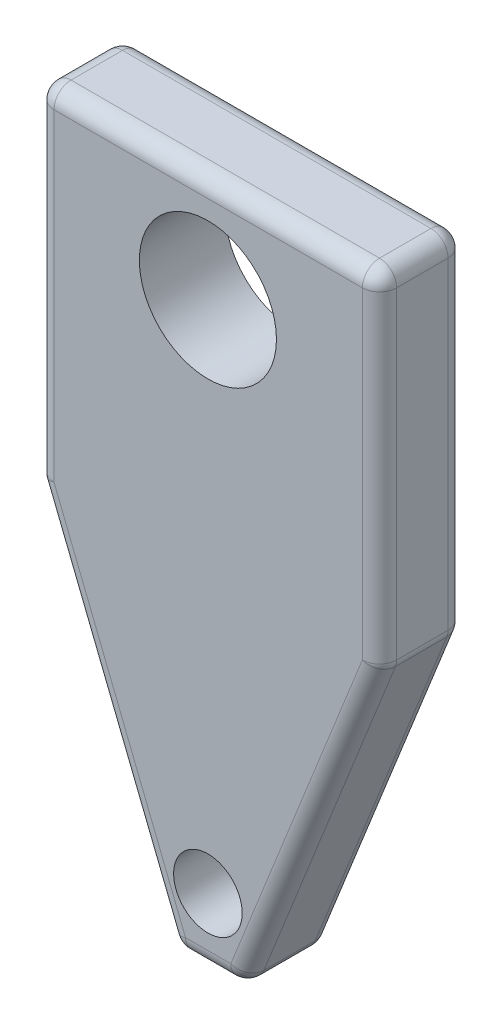
ISO-10303-21;
HEADER;
FILE_DESCRIPTION(('STEP AP214'),'2;1');
FILE_NAME('part.step','',(''),(''),'','','');
FILE_SCHEMA(('AUTOMOTIVE_DESIGN { 1 0 10303 214 1 1 1 1 }'));
ENDSEC;
DATA;
#1=APPLICATION_CONTEXT('core data for automotive mechanical design processes');
#2=APPLICATION_PROTOCOL_DEFINITION('international standard','automotive_design',2000,#1);
#3=PRODUCT_CONTEXT('',#1,'mechanical');
#4=PRODUCT('Part','Part','',(#3));
#5=PRODUCT_RELATED_PRODUCT_CATEGORY('part','',(#4));
#6=PRODUCT_DEFINITION_FORMATION('','',#4);
#7=PRODUCT_DEFINITION_CONTEXT('part definition',#1,'design');
#8=PRODUCT_DEFINITION('design','',#6,#7);
#9=PRODUCT_DEFINITION_SHAPE('','',#8);
#10=(LENGTH_UNIT() NAMED_UNIT(*) SI_UNIT(.MILLI.,.METRE.));
#11=(NAMED_UNIT(*) PLANE_ANGLE_UNIT() SI_UNIT($,.RADIAN.));
#12=(NAMED_UNIT(*) SI_UNIT($,.STERADIAN.) SOLID_ANGLE_UNIT());
#13=UNCERTAINTY_MEASURE_WITH_UNIT(LENGTH_MEASURE(1.E-05),#10,'distance_accuracy_value','');
#14=(GEOMETRIC_REPRESENTATION_CONTEXT(3) GLOBAL_UNCERTAINTY_ASSIGNED_CONTEXT((#13)) GLOBAL_UNIT_ASSIGNED_CONTEXT((#10,
#11,#12)) REPRESENTATION_CONTEXT('',''));
#15=CARTESIAN_POINT('',(0.,0.,0.));
#16=DIRECTION('',(0.,0.,1.));
#17=DIRECTION('',(1.,0.,0.));
#18=AXIS2_PLACEMENT_3D('',#15,#16,#17);
#19=CARTESIAN_POINT('',(0.,0.,5.));
#20=DIRECTION('',(0.,0.,1.));
#21=DIRECTION('',(1.,0.,0.));
#22=AXIS2_PLACEMENT_3D('',#19,#20,#21);
#23=PLANE('',#22);
#24=DIRECTION('',(0.,1.,0.));
#25=VECTOR('',#24,1.);
#26=CARTESIAN_POINT('',(19.,0.,5.));
#27=LINE('',#26,#25);
#28=CARTESIAN_POINT('',(19.,-19.8074175964328,5.));
#29=VERTEX_POINT('',#28);
#30=CARTESIAN_POINT('',(19.,-1.,5.));
#31=VERTEX_POINT('',#30);
#32=EDGE_CURVE('E193',#29,#31,#27,.T.);
#33=ORIENTED_EDGE('',*,*,#32,.T.);
#34=DIRECTION('',(-1.,0.,0.));
#35=VECTOR('',#34,1.);
#36=CARTESIAN_POINT('',(0.,-1.,5.));
#37=LINE('',#36,#35);
#38=CARTESIAN_POINT('',(1.,-1.,5.));
#39=VERTEX_POINT('',#38);
#40=EDGE_CURVE('E199',#31,#39,#37,.T.);
#41=ORIENTED_EDGE('',*,*,#40,.T.);
#42=DIRECTION('',(0.,-1.,0.));
#43=VECTOR('',#42,1.);
#44=CARTESIAN_POINT('',(1.,-20.,5.));
#45=LINE('',#44,#43);
#46=CARTESIAN_POINT('',(1.,-19.8074175964327,5.));
#47=VERTEX_POINT('',#46);
#48=EDGE_CURVE('E191',#39,#47,#45,.T.);
#49=ORIENTED_EDGE('',*,*,#48,.T.);
#50=DIRECTION('',(0.371390676354104,-0.928476690885259,0.));
#51=VECTOR('',#50,1.);
#52=CARTESIAN_POINT('',(8.92847669088527,-39.6286093236459,5.));
#53=LINE('',#52,#51);
#54=CARTESIAN_POINT('',(8.6770329614269,-39.,5.));
#55=VERTEX_POINT('',#54);
#56=EDGE_CURVE('E162',#47,#55,#53,.T.);
#57=ORIENTED_EDGE('',*,*,#56,.T.);
#58=DIRECTION('',(1.,0.,0.));
#59=VECTOR('',#58,1.);
#60=CARTESIAN_POINT('',(12.,-39.,5.));
#61=LINE('',#60,#59);
#62=CARTESIAN_POINT('',(11.3229670385731,-39.,5.));
#63=VERTEX_POINT('',#62);
#64=EDGE_CURVE('E180',#55,#63,#61,.T.);
#65=ORIENTED_EDGE('',*,*,#64,.T.);
#66=DIRECTION('',(0.371390676354104,0.928476690885259,0.));
#67=VECTOR('',#66,1.);
#68=CARTESIAN_POINT('',(19.0715233091147,-19.6286093236459,5.));
#69=LINE('',#68,#67);
#70=EDGE_CURVE('E186',#63,#29,#69,.T.);
#71=ORIENTED_EDGE('',*,*,#70,.T.);
#72=EDGE_LOOP('',(#33,#41,#49,#57,#65,#71));
#73=FACE_BOUND('',#72,.T.);
#74=CARTESIAN_POINT('',(9.98459852662277,-6.11486343196653,5.));
#75=DIRECTION('',(0.,0.,1.));
#76=DIRECTION('',(1.,0.,0.));
#77=AXIS2_PLACEMENT_3D('',#74,#75,#76);
#78=CIRCLE('',#77,4.);
#79=CARTESIAN_POINT('',(13.9845985266228,-6.11486343196653,5.));
#80=VERTEX_POINT('',#79);
#81=EDGE_CURVE('E187',#80,#80,#78,.T.);
#82=ORIENTED_EDGE('',*,*,#81,.F.);
#83=EDGE_LOOP('',(#82));
#84=FACE_BOUND('',#83,.T.);
#85=CARTESIAN_POINT('',(9.98459852662277,-36.1148634319665,5.));
#86=DIRECTION('',(0.,0.,1.));
#87=DIRECTION('',(1.,0.,0.));
#88=AXIS2_PLACEMENT_3D('',#85,#86,#87);
#89=CIRCLE('',#88,2.);
#90=CARTESIAN_POINT('',(11.9845985266228,-36.1148634319665,5.));
#91=VERTEX_POINT('',#90);
#92=EDGE_CURVE('E358',#91,#91,#89,.T.);
#93=ORIENTED_EDGE('',*,*,#92,.F.);
#94=EDGE_LOOP('',(#93));
#95=FACE_BOUND('',#94,.T.);
#96=ADVANCED_FACE('F33',(#73,#84,#95),#23,.T.);
#97=CARTESIAN_POINT('',(0.,0.,0.));
#98=DIRECTION('',(0.,0.,1.));
#99=DIRECTION('',(1.,0.,0.));
#100=AXIS2_PLACEMENT_3D('',#97,#98,#99);
#101=PLANE('',#100);
#102=DIRECTION('',(0.,-1.,0.));
#103=VECTOR('',#102,1.);
#104=CARTESIAN_POINT('',(1.,0.,0.));
#105=LINE('',#104,#103);
#106=CARTESIAN_POINT('',(1.,-19.8074175964327,0.));
#107=VERTEX_POINT('',#106);
#108=CARTESIAN_POINT('',(1.,-1.,0.));
#109=VERTEX_POINT('',#108);
#110=EDGE_CURVE('E226',#107,#109,#105,.F.);
#111=ORIENTED_EDGE('',*,*,#110,.T.);
#112=DIRECTION('',(-1.,0.,0.));
#113=VECTOR('',#112,1.);
#114=CARTESIAN_POINT('',(0.,-1.,0.));
#115=LINE('',#114,#113);
#116=CARTESIAN_POINT('',(19.,-1.,0.));
#117=VERTEX_POINT('',#116);
#118=EDGE_CURVE('E228',#109,#117,#115,.F.);
#119=ORIENTED_EDGE('',*,*,#118,.T.);
#120=DIRECTION('',(0.,1.,0.));
#121=VECTOR('',#120,1.);
#122=CARTESIAN_POINT('',(19.,0.,0.));
#123=LINE('',#122,#121);
#124=CARTESIAN_POINT('',(19.,-19.8074175964327,0.));
#125=VERTEX_POINT('',#124);
#126=EDGE_CURVE('E224',#117,#125,#123,.F.);
#127=ORIENTED_EDGE('',*,*,#126,.T.);
#128=DIRECTION('',(0.371390676354104,0.928476690885259,0.));
#129=VECTOR('',#128,1.);
#130=CARTESIAN_POINT('',(23.2094543435975,-9.283781737439,0.));
#131=LINE('',#130,#129);
#132=CARTESIAN_POINT('',(11.3229670385731,-39.,0.));
#133=VERTEX_POINT('',#132);
#134=EDGE_CURVE('E219',#125,#133,#131,.F.);
#135=ORIENTED_EDGE('',*,*,#134,.T.);
#136=DIRECTION('',(1.,0.,0.));
#137=VECTOR('',#136,1.);
#138=CARTESIAN_POINT('',(0.,-39.,0.));
#139=LINE('',#138,#137);
#140=CARTESIAN_POINT('',(8.67703296142691,-39.,0.));
#141=VERTEX_POINT('',#140);
#142=EDGE_CURVE('E217',#133,#141,#139,.F.);
#143=ORIENTED_EDGE('',*,*,#142,.T.);
#144=DIRECTION('',(0.371390676354104,-0.928476690885259,0.));
#145=VECTOR('',#144,1.);
#146=CARTESIAN_POINT('',(-5.96807503325267,-2.38723001330107,0.));
#147=LINE('',#146,#145);
#148=EDGE_CURVE('E221',#141,#107,#147,.F.);
#149=ORIENTED_EDGE('',*,*,#148,.T.);
#150=EDGE_LOOP('',(#111,#119,#127,#135,#143,#149));
#151=FACE_BOUND('',#150,.T.);
#152=CARTESIAN_POINT('',(9.98459852662277,-6.11486343196653,0.));
#153=DIRECTION('',(0.,0.,1.));
#154=DIRECTION('',(1.,0.,0.));
#155=AXIS2_PLACEMENT_3D('',#152,#153,#154);
#156=CIRCLE('',#155,4.);
#157=CARTESIAN_POINT('',(13.9845985266228,-6.11486343196653,0.));
#158=VERTEX_POINT('',#157);
#159=EDGE_CURVE('E363',#158,#158,#156,.T.);
#160=ORIENTED_EDGE('',*,*,#159,.T.);
#161=EDGE_LOOP('',(#160));
#162=FACE_BOUND('',#161,.T.);
#163=CARTESIAN_POINT('',(9.98459852662277,-36.1148634319665,0.));
#164=DIRECTION('',(0.,0.,1.));
#165=DIRECTION('',(1.,0.,0.));
#166=AXIS2_PLACEMENT_3D('',#163,#164,#165);
#167=CIRCLE('',#166,2.);
#168=CARTESIAN_POINT('',(11.9845985266228,-36.1148634319665,0.));
#169=VERTEX_POINT('',#168);
#170=EDGE_CURVE('E352',#169,#169,#167,.T.);
#171=ORIENTED_EDGE('',*,*,#170,.T.);
#172=EDGE_LOOP('',(#171));
#173=FACE_BOUND('',#172,.T.);
#174=ADVANCED_FACE('F371',(#151,#162,#173),#101,.F.);
#175=CARTESIAN_POINT('',(0.,0.,5.));
#176=DIRECTION('',(1.,0.,0.));
#177=DIRECTION('',(0.,1.,0.));
#178=AXIS2_PLACEMENT_3D('',#175,#176,#177);
#179=PLANE('',#178);
#180=DIRECTION('',(0.,0.,-1.));
#181=VECTOR('',#180,1.);
#182=CARTESIAN_POINT('',(0.,-19.8074175964327,5.));
#183=LINE('',#182,#181);
#184=CARTESIAN_POINT('',(0.,-19.8074175964327,1.));
#185=VERTEX_POINT('',#184);
#186=CARTESIAN_POINT('',(0.,-19.8074175964327,4.));
#187=VERTEX_POINT('',#186);
#188=EDGE_CURVE('E234',#185,#187,#183,.F.);
#189=ORIENTED_EDGE('',*,*,#188,.T.);
#190=DIRECTION('',(0.,-1.,0.));
#191=VECTOR('',#190,1.);
#192=CARTESIAN_POINT('',(0.,0.,4.));
#193=LINE('',#192,#191);
#194=CARTESIAN_POINT('',(0.,-1.,4.));
#195=VERTEX_POINT('',#194);
#196=EDGE_CURVE('E236',#187,#195,#193,.F.);
#197=ORIENTED_EDGE('',*,*,#196,.T.);
#198=DIRECTION('',(0.,0.,-1.));
#199=VECTOR('',#198,1.);
#200=CARTESIAN_POINT('',(0.,-1.,5.));
#201=LINE('',#200,#199);
#202=CARTESIAN_POINT('',(0.,-1.,1.));
#203=VERTEX_POINT('',#202);
#204=EDGE_CURVE('E230',#195,#203,#201,.T.);
#205=ORIENTED_EDGE('',*,*,#204,.T.);
#206=DIRECTION('',(0.,-1.,0.));
#207=VECTOR('',#206,1.);
#208=CARTESIAN_POINT('',(0.,0.,1.));
#209=LINE('',#208,#207);
#210=EDGE_CURVE('E232',#203,#185,#209,.T.);
#211=ORIENTED_EDGE('',*,*,#210,.T.);
#212=EDGE_LOOP('',(#189,#197,#205,#211));
#213=FACE_BOUND('',#212,.T.);
#214=ADVANCED_FACE('F392',(#213),#179,.F.);
#215=CARTESIAN_POINT('',(0.,-20.,5.));
#216=DIRECTION('',(0.928476690885259,0.371390676354104,0.));
#217=DIRECTION('',(-0.371390676354104,0.928476690885259,0.));
#218=AXIS2_PLACEMENT_3D('',#215,#216,#217);
#219=PLANE('',#218);
#220=DIRECTION('',(0.,0.,-1.));
#221=VECTOR('',#220,1.);
#222=CARTESIAN_POINT('',(7.74855627054165,-39.3713906763541,5.));
#223=LINE('',#222,#221);
#224=CARTESIAN_POINT('',(7.74855627054165,-39.3713906763541,1.));
#225=VERTEX_POINT('',#224);
#226=CARTESIAN_POINT('',(7.74855627054165,-39.3713906763541,4.));
#227=VERTEX_POINT('',#226);
#228=EDGE_CURVE('E205',#225,#227,#223,.F.);
#229=ORIENTED_EDGE('',*,*,#228,.T.);
#230=DIRECTION('',(0.371390676354104,-0.928476690885259,0.));
#231=VECTOR('',#230,1.);
#232=CARTESIAN_POINT('',(0.,-20.,4.));
#233=LINE('',#232,#231);
#234=CARTESIAN_POINT('',(0.071523309114743,-20.1788082727869,4.));
#235=VERTEX_POINT('',#234);
#236=EDGE_CURVE('E164',#227,#235,#233,.F.);
#237=ORIENTED_EDGE('',*,*,#236,.T.);
#238=DIRECTION('',(0.,0.,-1.));
#239=VECTOR('',#238,1.);
#240=CARTESIAN_POINT('',(0.071523309114743,-20.1788082727869,5.));
#241=LINE('',#240,#239);
#242=CARTESIAN_POINT('',(0.071523309114743,-20.1788082727869,1.));
#243=VERTEX_POINT('',#242);
#244=EDGE_CURVE('E201',#235,#243,#241,.T.);
#245=ORIENTED_EDGE('',*,*,#244,.T.);
#246=DIRECTION('',(0.371390676354104,-0.928476690885259,0.));
#247=VECTOR('',#246,1.);
#248=CARTESIAN_POINT('',(0.,-20.,1.));
#249=LINE('',#248,#247);
#250=EDGE_CURVE('E203',#243,#225,#249,.T.);
#251=ORIENTED_EDGE('',*,*,#250,.T.);
#252=EDGE_LOOP('',(#229,#237,#245,#251));
#253=FACE_BOUND('',#252,.T.);
#254=ADVANCED_FACE('F406',(#253),#219,.F.);
#255=CARTESIAN_POINT('',(8.00000000000001,-40.,5.));
#256=DIRECTION('',(0.,1.,0.));
#257=DIRECTION('',(0.,0.,1.));
#258=AXIS2_PLACEMENT_3D('',#255,#256,#257);
#259=PLANE('',#258);
#260=DIRECTION('',(0.,0.,-1.));
#261=VECTOR('',#260,1.);
#262=CARTESIAN_POINT('',(8.67703296142691,-40.,5.));
#263=LINE('',#262,#261);
#264=CARTESIAN_POINT('',(8.67703296142691,-40.,4.));
#265=VERTEX_POINT('',#264);
#266=CARTESIAN_POINT('',(8.67703296142691,-40.,1.));
#267=VERTEX_POINT('',#266);
#268=EDGE_CURVE('E212',#265,#267,#263,.T.);
#269=ORIENTED_EDGE('',*,*,#268,.T.);
#270=DIRECTION('',(1.,0.,0.));
#271=VECTOR('',#270,1.);
#272=CARTESIAN_POINT('',(8.00000000000001,-40.,1.));
#273=LINE('',#272,#271);
#274=CARTESIAN_POINT('',(11.3229670385731,-40.,1.));
#275=VERTEX_POINT('',#274);
#276=EDGE_CURVE('E215',#267,#275,#273,.T.);
#277=ORIENTED_EDGE('',*,*,#276,.T.);
#278=DIRECTION('',(0.,0.,-1.));
#279=VECTOR('',#278,1.);
#280=CARTESIAN_POINT('',(11.3229670385731,-40.,5.));
#281=LINE('',#280,#279);
#282=CARTESIAN_POINT('',(11.3229670385731,-40.,4.));
#283=VERTEX_POINT('',#282);
#284=EDGE_CURVE('E210',#275,#283,#281,.F.);
#285=ORIENTED_EDGE('',*,*,#284,.T.);
#286=DIRECTION('',(1.,0.,0.));
#287=VECTOR('',#286,1.);
#288=CARTESIAN_POINT('',(8.00000000000001,-40.,4.));
#289=LINE('',#288,#287);
#290=EDGE_CURVE('E208',#283,#265,#289,.F.);
#291=ORIENTED_EDGE('',*,*,#290,.T.);
#292=EDGE_LOOP('',(#269,#277,#285,#291));
#293=FACE_BOUND('',#292,.T.);
#294=ADVANCED_FACE('F402',(#293),#259,.F.);
#295=CARTESIAN_POINT('',(20.,-20.,5.));
#296=DIRECTION('',(-0.928476690885259,0.371390676354104,0.));
#297=DIRECTION('',(-0.371390676354104,-0.928476690885259,0.));
#298=AXIS2_PLACEMENT_3D('',#295,#296,#297);
#299=PLANE('',#298);
#300=DIRECTION('',(0.371390676354104,0.928476690885259,0.));
#301=VECTOR('',#300,1.);
#302=CARTESIAN_POINT('',(12.,-40.,4.));
#303=LINE('',#302,#301);
#304=CARTESIAN_POINT('',(19.9284766908853,-20.1788082727869,4.));
#305=VERTEX_POINT('',#304);
#306=CARTESIAN_POINT('',(12.2514437294584,-39.3713906763541,4.));
#307=VERTEX_POINT('',#306);
#308=EDGE_CURVE('E243',#305,#307,#303,.F.);
#309=ORIENTED_EDGE('',*,*,#308,.T.);
#310=DIRECTION('',(0.,0.,-1.));
#311=VECTOR('',#310,1.);
#312=CARTESIAN_POINT('',(12.2514437294584,-39.3713906763541,5.));
#313=LINE('',#312,#311);
#314=CARTESIAN_POINT('',(12.2514437294584,-39.3713906763541,1.));
#315=VERTEX_POINT('',#314);
#316=EDGE_CURVE('E245',#307,#315,#313,.T.);
#317=ORIENTED_EDGE('',*,*,#316,.T.);
#318=DIRECTION('',(0.371390676354104,0.928476690885259,0.));
#319=VECTOR('',#318,1.);
#320=CARTESIAN_POINT('',(20.,-20.,1.));
#321=LINE('',#320,#319);
#322=CARTESIAN_POINT('',(19.9284766908853,-20.1788082727869,1.));
#323=VERTEX_POINT('',#322);
#324=EDGE_CURVE('E241',#315,#323,#321,.T.);
#325=ORIENTED_EDGE('',*,*,#324,.T.);
#326=DIRECTION('',(0.,0.,-1.));
#327=VECTOR('',#326,1.);
#328=CARTESIAN_POINT('',(19.9284766908853,-20.1788082727869,5.));
#329=LINE('',#328,#327);
#330=EDGE_CURVE('E239',#323,#305,#329,.F.);
#331=ORIENTED_EDGE('',*,*,#330,.T.);
#332=EDGE_LOOP('',(#309,#317,#325,#331));
#333=FACE_BOUND('',#332,.T.);
#334=ADVANCED_FACE('F398',(#333),#299,.F.);
#335=CARTESIAN_POINT('',(20.,0.,5.));
#336=DIRECTION('',(-1.,0.,0.));
#337=DIRECTION('',(0.,-1.,0.));
#338=AXIS2_PLACEMENT_3D('',#335,#336,#337);
#339=PLANE('',#338);
#340=DIRECTION('',(0.,1.,0.));
#341=VECTOR('',#340,1.);
#342=CARTESIAN_POINT('',(20.,-20.,4.));
#343=LINE('',#342,#341);
#344=CARTESIAN_POINT('',(20.,-1.,4.));
#345=VERTEX_POINT('',#344);
#346=CARTESIAN_POINT('',(20.,-19.8074175964327,4.));
#347=VERTEX_POINT('',#346);
#348=EDGE_CURVE('E252',#345,#347,#343,.F.);
#349=ORIENTED_EDGE('',*,*,#348,.T.);
#350=DIRECTION('',(0.,0.,-1.));
#351=VECTOR('',#350,1.);
#352=CARTESIAN_POINT('',(20.,-19.8074175964327,5.));
#353=LINE('',#352,#351);
#354=CARTESIAN_POINT('',(20.,-19.8074175964327,1.));
#355=VERTEX_POINT('',#354);
#356=EDGE_CURVE('E254',#347,#355,#353,.T.);
#357=ORIENTED_EDGE('',*,*,#356,.T.);
#358=DIRECTION('',(0.,1.,0.));
#359=VECTOR('',#358,1.);
#360=CARTESIAN_POINT('',(20.,0.,1.));
#361=LINE('',#360,#359);
#362=CARTESIAN_POINT('',(20.,-1.,1.));
#363=VERTEX_POINT('',#362);
#364=EDGE_CURVE('E250',#355,#363,#361,.T.);
#365=ORIENTED_EDGE('',*,*,#364,.T.);
#366=DIRECTION('',(0.,0.,-1.));
#367=VECTOR('',#366,1.);
#368=CARTESIAN_POINT('',(20.,-1.,5.));
#369=LINE('',#368,#367);
#370=EDGE_CURVE('E248',#363,#345,#369,.F.);
#371=ORIENTED_EDGE('',*,*,#370,.T.);
#372=EDGE_LOOP('',(#349,#357,#365,#371));
#373=FACE_BOUND('',#372,.T.);
#374=ADVANCED_FACE('F385',(#373),#339,.F.);
#375=CARTESIAN_POINT('',(0.,0.,5.));
#376=DIRECTION('',(0.,-1.,0.));
#377=DIRECTION('',(0.,0.,-1.));
#378=AXIS2_PLACEMENT_3D('',#375,#376,#377);
#379=PLANE('',#378);
#380=DIRECTION('',(-1.,0.,0.));
#381=VECTOR('',#380,1.);
#382=CARTESIAN_POINT('',(20.,0.,4.));
#383=LINE('',#382,#381);
#384=CARTESIAN_POINT('',(1.,0.,4.));
#385=VERTEX_POINT('',#384);
#386=CARTESIAN_POINT('',(19.,0.,4.));
#387=VERTEX_POINT('',#386);
#388=EDGE_CURVE('E42',#385,#387,#383,.F.);
#389=ORIENTED_EDGE('',*,*,#388,.T.);
#390=DIRECTION('',(0.,0.,-1.));
#391=VECTOR('',#390,1.);
#392=CARTESIAN_POINT('',(19.,0.,5.));
#393=LINE('',#392,#391);
#394=CARTESIAN_POINT('',(19.,0.,1.));
#395=VERTEX_POINT('',#394);
#396=EDGE_CURVE('E11',#387,#395,#393,.T.);
#397=ORIENTED_EDGE('',*,*,#396,.T.);
#398=DIRECTION('',(-1.,0.,0.));
#399=VECTOR('',#398,1.);
#400=CARTESIAN_POINT('',(0.,0.,1.));
#401=LINE('',#400,#399);
#402=CARTESIAN_POINT('',(1.,0.,1.));
#403=VERTEX_POINT('',#402);
#404=EDGE_CURVE('E257',#395,#403,#401,.T.);
#405=ORIENTED_EDGE('',*,*,#404,.T.);
#406=DIRECTION('',(0.,0.,-1.));
#407=VECTOR('',#406,1.);
#408=CARTESIAN_POINT('',(1.,0.,5.));
#409=LINE('',#408,#407);
#410=EDGE_CURVE('E53',#403,#385,#409,.F.);
#411=ORIENTED_EDGE('',*,*,#410,.T.);
#412=EDGE_LOOP('',(#389,#397,#405,#411));
#413=FACE_BOUND('',#412,.T.);
#414=ADVANCED_FACE('F376',(#413),#379,.F.);
#415=CARTESIAN_POINT('',(9.98459852662277,-6.11486343196653,5.));
#416=DIRECTION('',(0.,0.,-1.));
#417=DIRECTION('',(-1.,0.,0.));
#418=AXIS2_PLACEMENT_3D('',#415,#416,#417);
#419=CYLINDRICAL_SURFACE('',#418,4.);
#420=ORIENTED_EDGE('',*,*,#81,.T.);
#421=EDGE_LOOP('',(#420));
#422=FACE_BOUND('',#421,.T.);
#423=ORIENTED_EDGE('',*,*,#159,.F.);
#424=EDGE_LOOP('',(#423));
#425=FACE_BOUND('',#424,.T.);
#426=ADVANCED_FACE('F373',(#422,#425),#419,.F.);
#427=CARTESIAN_POINT('',(9.98459852662277,-36.1148634319665,5.));
#428=DIRECTION('',(0.,0.,-1.));
#429=DIRECTION('',(-1.,0.,0.));
#430=AXIS2_PLACEMENT_3D('',#427,#428,#429);
#431=CYLINDRICAL_SURFACE('',#430,2.);
#432=ORIENTED_EDGE('',*,*,#92,.T.);
#433=EDGE_LOOP('',(#432));
#434=FACE_BOUND('',#433,.T.);
#435=ORIENTED_EDGE('',*,*,#170,.F.);
#436=EDGE_LOOP('',(#435));
#437=FACE_BOUND('',#436,.T.);
#438=ADVANCED_FACE('F375',(#434,#437),#431,.F.);
#439=CARTESIAN_POINT('',(19.,0.,1.));
#440=DIRECTION('',(0.,1.,0.));
#441=DIRECTION('',(-1.,0.,0.));
#442=AXIS2_PLACEMENT_3D('',#439,#440,#441);
#443=CYLINDRICAL_SURFACE('',#442,1.);
#444=CARTESIAN_POINT('',(19.,-1.,1.));
#445=DIRECTION('',(0.,1.,0.));
#446=DIRECTION('',(-1.,0.,0.));
#447=AXIS2_PLACEMENT_3D('',#444,#445,#446);
#448=CIRCLE('',#447,1.);
#449=EDGE_CURVE('E37',#363,#117,#448,.T.);
#450=ORIENTED_EDGE('',*,*,#449,.F.);
#451=ORIENTED_EDGE('',*,*,#364,.F.);
#452=CARTESIAN_POINT('',(19.,-19.8074175964327,1.));
#453=DIRECTION('',(0.,-1.,0.));
#454=DIRECTION('',(0.,0.,-1.));
#455=AXIS2_PLACEMENT_3D('',#452,#453,#454);
#456=CIRCLE('',#455,1.);
#457=EDGE_CURVE('E344',#125,#355,#456,.T.);
#458=ORIENTED_EDGE('',*,*,#457,.F.);
#459=ORIENTED_EDGE('',*,*,#126,.F.);
#460=EDGE_LOOP('',(#450,#451,#458,#459));
#461=FACE_BOUND('',#460,.T.);
#462=ADVANCED_FACE('F35',(#461),#443,.T.);
#463=CARTESIAN_POINT('',(19.,-1.,1.));
#464=DIRECTION('',(0.,0.,1.));
#465=DIRECTION('',(1.,0.,0.));
#466=AXIS2_PLACEMENT_3D('',#463,#464,#465);
#467=SPHERICAL_SURFACE('',#466,1.);
#468=CARTESIAN_POINT('',(19.,-1.,1.));
#469=DIRECTION('',(0.,0.,-1.));
#470=DIRECTION('',(-1.,0.,0.));
#471=AXIS2_PLACEMENT_3D('',#468,#469,#470);
#472=CIRCLE('',#471,1.);
#473=EDGE_CURVE('E339',#363,#395,#472,.F.);
#474=ORIENTED_EDGE('',*,*,#473,.F.);
#475=ORIENTED_EDGE('',*,*,#449,.T.);
#476=CARTESIAN_POINT('',(19.,-1.,1.));
#477=DIRECTION('',(1.,0.,0.));
#478=DIRECTION('',(0.,0.,-1.));
#479=AXIS2_PLACEMENT_3D('',#476,#477,#478);
#480=CIRCLE('',#479,1.);
#481=EDGE_CURVE('E342',#395,#117,#480,.F.);
#482=ORIENTED_EDGE('',*,*,#481,.F.);
#483=EDGE_LOOP('',(#474,#475,#482));
#484=FACE_BOUND('',#483,.T.);
#485=ADVANCED_FACE('F518',(#484),#467,.T.);
#486=CARTESIAN_POINT('',(19.,-19.8074175964327,1.));
#487=DIRECTION('',(0.,0.,1.));
#488=DIRECTION('',(1.,0.,0.));
#489=AXIS2_PLACEMENT_3D('',#486,#487,#488);
#490=SPHERICAL_SURFACE('',#489,1.);
#491=CARTESIAN_POINT('',(19.,-19.8074175964327,1.));
#492=DIRECTION('',(0.371390676354104,0.928476690885259,0.));
#493=DIRECTION('',(-0.928476690885259,0.371390676354104,0.));
#494=AXIS2_PLACEMENT_3D('',#491,#492,#493);
#495=CIRCLE('',#494,1.);
#496=EDGE_CURVE('E334',#125,#323,#495,.F.);
#497=ORIENTED_EDGE('',*,*,#496,.F.);
#498=ORIENTED_EDGE('',*,*,#457,.T.);
#499=CARTESIAN_POINT('',(19.,-19.8074175964327,1.));
#500=DIRECTION('',(0.,0.,-1.));
#501=DIRECTION('',(-1.,0.,0.));
#502=AXIS2_PLACEMENT_3D('',#499,#500,#501);
#503=CIRCLE('',#502,1.);
#504=EDGE_CURVE('E337',#323,#355,#503,.F.);
#505=ORIENTED_EDGE('',*,*,#504,.F.);
#506=EDGE_LOOP('',(#497,#498,#505));
#507=FACE_BOUND('',#506,.T.);
#508=ADVANCED_FACE('F515',(#507),#490,.T.);
#509=CARTESIAN_POINT('',(0.,-1.,1.));
#510=DIRECTION('',(-1.,0.,0.));
#511=DIRECTION('',(0.,0.,1.));
#512=AXIS2_PLACEMENT_3D('',#509,#510,#511);
#513=CYLINDRICAL_SURFACE('',#512,1.);
#514=ORIENTED_EDGE('',*,*,#481,.T.);
#515=ORIENTED_EDGE('',*,*,#118,.F.);
#516=CARTESIAN_POINT('',(1.,-1.,1.));
#517=DIRECTION('',(-1.,0.,0.));
#518=DIRECTION('',(0.,0.,1.));
#519=AXIS2_PLACEMENT_3D('',#516,#517,#518);
#520=CIRCLE('',#519,1.);
#521=EDGE_CURVE('E331',#403,#109,#520,.T.);
#522=ORIENTED_EDGE('',*,*,#521,.F.);
#523=ORIENTED_EDGE('',*,*,#404,.F.);
#524=EDGE_LOOP('',(#514,#515,#522,#523));
#525=FACE_BOUND('',#524,.T.);
#526=ADVANCED_FACE('F511',(#525),#513,.T.);
#527=CARTESIAN_POINT('',(19.,-1.,5.));
#528=DIRECTION('',(0.,0.,-1.));
#529=DIRECTION('',(-1.,0.,0.));
#530=AXIS2_PLACEMENT_3D('',#527,#528,#529);
#531=CYLINDRICAL_SURFACE('',#530,1.);
#532=ORIENTED_EDGE('',*,*,#473,.T.);
#533=ORIENTED_EDGE('',*,*,#396,.F.);
#534=CARTESIAN_POINT('',(19.,-1.,4.));
#535=DIRECTION('',(0.,0.,1.));
#536=DIRECTION('',(1.,0.,0.));
#537=AXIS2_PLACEMENT_3D('',#534,#535,#536);
#538=CIRCLE('',#537,1.);
#539=EDGE_CURVE('E328',#345,#387,#538,.T.);
#540=ORIENTED_EDGE('',*,*,#539,.F.);
#541=ORIENTED_EDGE('',*,*,#370,.F.);
#542=EDGE_LOOP('',(#532,#533,#540,#541));
#543=FACE_BOUND('',#542,.T.);
#544=ADVANCED_FACE('F507',(#543),#531,.T.);
#545=CARTESIAN_POINT('',(19.,0.,4.));
#546=DIRECTION('',(0.,-1.,0.));
#547=DIRECTION('',(1.,0.,0.));
#548=AXIS2_PLACEMENT_3D('',#545,#546,#547);
#549=CYLINDRICAL_SURFACE('',#548,1.);
#550=CARTESIAN_POINT('',(19.,-19.8074175964327,4.));
#551=DIRECTION('',(0.,-1.,0.));
#552=DIRECTION('',(0.,0.,-1.));
#553=AXIS2_PLACEMENT_3D('',#550,#551,#552);
#554=CIRCLE('',#553,1.);
#555=EDGE_CURVE('E322',#347,#29,#554,.T.);
#556=ORIENTED_EDGE('',*,*,#555,.F.);
#557=ORIENTED_EDGE('',*,*,#348,.F.);
#558=CARTESIAN_POINT('',(19.,-1.,4.));
#559=DIRECTION('',(0.,1.,0.));
#560=DIRECTION('',(-1.,0.,0.));
#561=AXIS2_PLACEMENT_3D('',#558,#559,#560);
#562=CIRCLE('',#561,1.);
#563=EDGE_CURVE('E325',#31,#345,#562,.T.);
#564=ORIENTED_EDGE('',*,*,#563,.F.);
#565=ORIENTED_EDGE('',*,*,#32,.F.);
#566=EDGE_LOOP('',(#556,#557,#564,#565));
#567=FACE_BOUND('',#566,.T.);
#568=ADVANCED_FACE('F503',(#567),#549,.T.);
#569=CARTESIAN_POINT('',(19.,-19.8074175964327,5.));
#570=DIRECTION('',(0.,0.,-1.));
#571=DIRECTION('',(-1.,0.,0.));
#572=AXIS2_PLACEMENT_3D('',#569,#570,#571);
#573=CYLINDRICAL_SURFACE('',#572,1.);
#574=ORIENTED_EDGE('',*,*,#504,.T.);
#575=ORIENTED_EDGE('',*,*,#356,.F.);
#576=CARTESIAN_POINT('',(19.,-19.8074175964327,4.));
#577=DIRECTION('',(0.,0.,1.));
#578=DIRECTION('',(1.,0.,0.));
#579=AXIS2_PLACEMENT_3D('',#576,#577,#578);
#580=CIRCLE('',#579,1.);
#581=EDGE_CURVE('E319',#305,#347,#580,.T.);
#582=ORIENTED_EDGE('',*,*,#581,.F.);
#583=ORIENTED_EDGE('',*,*,#330,.F.);
#584=EDGE_LOOP('',(#574,#575,#582,#583));
#585=FACE_BOUND('',#584,.T.);
#586=ADVANCED_FACE('F499',(#585),#573,.T.);
#587=CARTESIAN_POINT('',(19.0715233091147,-19.6286093236459,1.));
#588=DIRECTION('',(0.371390676354104,0.928476690885259,0.));
#589=DIRECTION('',(-0.928476690885259,0.371390676354104,0.));
#590=AXIS2_PLACEMENT_3D('',#587,#588,#589);
#591=CYLINDRICAL_SURFACE('',#590,1.);
#592=ORIENTED_EDGE('',*,*,#496,.T.);
#593=ORIENTED_EDGE('',*,*,#324,.F.);
#594=CARTESIAN_POINT('',(11.3229670385731,-39.,1.));
#595=DIRECTION('',(-0.371390676354104,-0.928476690885259,0.));
#596=DIRECTION('',(0.928476690885259,-0.371390676354104,0.));
#597=AXIS2_PLACEMENT_3D('',#594,#595,#596);
#598=CIRCLE('',#597,1.);
#599=EDGE_CURVE('E316',#133,#315,#598,.T.);
#600=ORIENTED_EDGE('',*,*,#599,.F.);
#601=ORIENTED_EDGE('',*,*,#134,.F.);
#602=EDGE_LOOP('',(#592,#593,#600,#601));
#603=FACE_BOUND('',#602,.T.);
#604=ADVANCED_FACE('F495',(#603),#591,.T.);
#605=CARTESIAN_POINT('',(1.,-1.,1.));
#606=DIRECTION('',(0.,0.,1.));
#607=DIRECTION('',(1.,0.,0.));
#608=AXIS2_PLACEMENT_3D('',#605,#606,#607);
#609=SPHERICAL_SURFACE('',#608,1.);
#610=CARTESIAN_POINT('',(1.,-1.,1.));
#611=DIRECTION('',(0.,0.,-1.));
#612=DIRECTION('',(-1.,0.,0.));
#613=AXIS2_PLACEMENT_3D('',#610,#611,#612);
#614=CIRCLE('',#613,1.);
#615=EDGE_CURVE('E310',#403,#203,#614,.F.);
#616=ORIENTED_EDGE('',*,*,#615,.F.);
#617=ORIENTED_EDGE('',*,*,#521,.T.);
#618=CARTESIAN_POINT('',(1.,-1.,1.));
#619=DIRECTION('',(0.,1.,0.));
#620=DIRECTION('',(-1.,0.,0.));
#621=AXIS2_PLACEMENT_3D('',#618,#619,#620);
#622=CIRCLE('',#621,1.);
#623=EDGE_CURVE('E313',#203,#109,#622,.F.);
#624=ORIENTED_EDGE('',*,*,#623,.F.);
#625=EDGE_LOOP('',(#616,#617,#624));
#626=FACE_BOUND('',#625,.T.);
#627=ADVANCED_FACE('F491',(#626),#609,.T.);
#628=CARTESIAN_POINT('',(19.,-1.,4.));
#629=DIRECTION('',(0.,0.,1.));
#630=DIRECTION('',(1.,0.,0.));
#631=AXIS2_PLACEMENT_3D('',#628,#629,#630);
#632=SPHERICAL_SURFACE('',#631,1.);
#633=ORIENTED_EDGE('',*,*,#563,.T.);
#634=ORIENTED_EDGE('',*,*,#539,.T.);
#635=CARTESIAN_POINT('',(19.,-1.,4.));
#636=DIRECTION('',(1.,0.,0.));
#637=DIRECTION('',(0.,0.,-1.));
#638=AXIS2_PLACEMENT_3D('',#635,#636,#637);
#639=CIRCLE('',#638,1.);
#640=EDGE_CURVE('E307',#31,#387,#639,.F.);
#641=ORIENTED_EDGE('',*,*,#640,.F.);
#642=EDGE_LOOP('',(#633,#634,#641));
#643=FACE_BOUND('',#642,.T.);
#644=ADVANCED_FACE('F487',(#643),#632,.T.);
#645=CARTESIAN_POINT('',(19.,-19.8074175964327,4.));
#646=DIRECTION('',(0.,0.,1.));
#647=DIRECTION('',(1.,0.,0.));
#648=AXIS2_PLACEMENT_3D('',#645,#646,#647);
#649=SPHERICAL_SURFACE('',#648,1.);
#650=ORIENTED_EDGE('',*,*,#581,.T.);
#651=ORIENTED_EDGE('',*,*,#555,.T.);
#652=CARTESIAN_POINT('',(19.,-19.8074175964328,4.));
#653=DIRECTION('',(0.371390676354098,0.928476690885262,0.));
#654=DIRECTION('',(-0.928476690885262,0.371390676354098,0.));
#655=AXIS2_PLACEMENT_3D('',#652,#653,#654);
#656=CIRCLE('',#655,1.);
#657=EDGE_CURVE('E304',#305,#29,#656,.F.);
#658=ORIENTED_EDGE('',*,*,#657,.F.);
#659=EDGE_LOOP('',(#650,#651,#658));
#660=FACE_BOUND('',#659,.T.);
#661=ADVANCED_FACE('F483',(#660),#649,.T.);
#662=CARTESIAN_POINT('',(11.3229670385731,-39.,1.));
#663=DIRECTION('',(0.,0.,1.));
#664=DIRECTION('',(1.,0.,0.));
#665=AXIS2_PLACEMENT_3D('',#662,#663,#664);
#666=SPHERICAL_SURFACE('',#665,1.);
#667=CARTESIAN_POINT('',(11.3229670385731,-39.,1.));
#668=DIRECTION('',(1.,0.,0.));
#669=DIRECTION('',(0.,0.,-1.));
#670=AXIS2_PLACEMENT_3D('',#667,#668,#669);
#671=CIRCLE('',#670,1.);
#672=EDGE_CURVE('E299',#133,#275,#671,.F.);
#673=ORIENTED_EDGE('',*,*,#672,.F.);
#674=ORIENTED_EDGE('',*,*,#599,.T.);
#675=CARTESIAN_POINT('',(11.3229670385731,-39.,1.));
#676=DIRECTION('',(0.,0.,-1.));
#677=DIRECTION('',(-1.,0.,0.));
#678=AXIS2_PLACEMENT_3D('',#675,#676,#677);
#679=CIRCLE('',#678,1.);
#680=EDGE_CURVE('E302',#275,#315,#679,.F.);
#681=ORIENTED_EDGE('',*,*,#680,.F.);
#682=EDGE_LOOP('',(#673,#674,#681));
#683=FACE_BOUND('',#682,.T.);
#684=ADVANCED_FACE('F479',(#683),#666,.T.);
#685=CARTESIAN_POINT('',(1.,0.,1.));
#686=DIRECTION('',(0.,-1.,0.));
#687=DIRECTION('',(1.,0.,0.));
#688=AXIS2_PLACEMENT_3D('',#685,#686,#687);
#689=CYLINDRICAL_SURFACE('',#688,1.);
#690=ORIENTED_EDGE('',*,*,#623,.T.);
#691=ORIENTED_EDGE('',*,*,#110,.F.);
#692=CARTESIAN_POINT('',(1.,-19.8074175964327,1.));
#693=DIRECTION('',(0.,-1.,0.));
#694=DIRECTION('',(0.,0.,-1.));
#695=AXIS2_PLACEMENT_3D('',#692,#693,#694);
#696=CIRCLE('',#695,1.);
#697=EDGE_CURVE('E294',#185,#107,#696,.T.);
#698=ORIENTED_EDGE('',*,*,#697,.F.);
#699=ORIENTED_EDGE('',*,*,#210,.F.);
#700=EDGE_LOOP('',(#690,#691,#698,#699));
#701=FACE_BOUND('',#700,.T.);
#702=ADVANCED_FACE('F475',(#701),#689,.T.);
#703=CARTESIAN_POINT('',(1.,-1.,5.));
#704=DIRECTION('',(0.,0.,-1.));
#705=DIRECTION('',(-1.,0.,0.));
#706=AXIS2_PLACEMENT_3D('',#703,#704,#705);
#707=CYLINDRICAL_SURFACE('',#706,1.);
#708=ORIENTED_EDGE('',*,*,#615,.T.);
#709=ORIENTED_EDGE('',*,*,#204,.F.);
#710=CARTESIAN_POINT('',(1.,-1.,4.));
#711=DIRECTION('',(0.,0.,1.));
#712=DIRECTION('',(1.,0.,0.));
#713=AXIS2_PLACEMENT_3D('',#710,#711,#712);
#714=CIRCLE('',#713,1.);
#715=EDGE_CURVE('E291',#385,#195,#714,.T.);
#716=ORIENTED_EDGE('',*,*,#715,.F.);
#717=ORIENTED_EDGE('',*,*,#410,.F.);
#718=EDGE_LOOP('',(#708,#709,#716,#717));
#719=FACE_BOUND('',#718,.T.);
#720=ADVANCED_FACE('F471',(#719),#707,.T.);
#721=CARTESIAN_POINT('',(0.,-1.,4.));
#722=DIRECTION('',(1.,0.,0.));
#723=DIRECTION('',(0.,0.,-1.));
#724=AXIS2_PLACEMENT_3D('',#721,#722,#723);
#725=CYLINDRICAL_SURFACE('',#724,1.);
#726=ORIENTED_EDGE('',*,*,#640,.T.);
#727=ORIENTED_EDGE('',*,*,#388,.F.);
#728=CARTESIAN_POINT('',(1.,-1.,4.));
#729=DIRECTION('',(-1.,0.,0.));
#730=DIRECTION('',(0.,-1.,0.));
#731=AXIS2_PLACEMENT_3D('',#728,#729,#730);
#732=CIRCLE('',#731,1.);
#733=EDGE_CURVE('E288',#39,#385,#732,.T.);
#734=ORIENTED_EDGE('',*,*,#733,.F.);
#735=ORIENTED_EDGE('',*,*,#40,.F.);
#736=EDGE_LOOP('',(#726,#727,#734,#735));
#737=FACE_BOUND('',#736,.T.);
#738=ADVANCED_FACE('F467',(#737),#725,.T.);
#739=CARTESIAN_POINT('',(23.2094543435975,-9.283781737439,4.));
#740=DIRECTION('',(-0.371390676354104,-0.928476690885259,0.));
#741=DIRECTION('',(0.928476690885259,-0.371390676354104,0.));
#742=AXIS2_PLACEMENT_3D('',#739,#740,#741);
#743=CYLINDRICAL_SURFACE('',#742,1.);
#744=ORIENTED_EDGE('',*,*,#657,.T.);
#745=ORIENTED_EDGE('',*,*,#70,.F.);
#746=CARTESIAN_POINT('',(11.3229670385731,-39.,4.));
#747=DIRECTION('',(-0.371390676354104,-0.928476690885259,0.));
#748=DIRECTION('',(0.928476690885259,-0.371390676354104,0.));
#749=AXIS2_PLACEMENT_3D('',#746,#747,#748);
#750=CIRCLE('',#749,1.);
#751=EDGE_CURVE('E285',#307,#63,#750,.T.);
#752=ORIENTED_EDGE('',*,*,#751,.F.);
#753=ORIENTED_EDGE('',*,*,#308,.F.);
#754=EDGE_LOOP('',(#744,#745,#752,#753));
#755=FACE_BOUND('',#754,.T.);
#756=ADVANCED_FACE('F463',(#755),#743,.T.);
#757=CARTESIAN_POINT('',(11.3229670385731,-39.,5.));
#758=DIRECTION('',(0.,0.,-1.));
#759=DIRECTION('',(-1.,0.,0.));
#760=AXIS2_PLACEMENT_3D('',#757,#758,#759);
#761=CYLINDRICAL_SURFACE('',#760,1.);
#762=ORIENTED_EDGE('',*,*,#680,.T.);
#763=ORIENTED_EDGE('',*,*,#316,.F.);
#764=CARTESIAN_POINT('',(11.3229670385731,-39.,4.));
#765=DIRECTION('',(0.,0.,1.));
#766=DIRECTION('',(1.,0.,0.));
#767=AXIS2_PLACEMENT_3D('',#764,#765,#766);
#768=CIRCLE('',#767,1.);
#769=EDGE_CURVE('E282',#283,#307,#768,.T.);
#770=ORIENTED_EDGE('',*,*,#769,.F.);
#771=ORIENTED_EDGE('',*,*,#284,.F.);
#772=EDGE_LOOP('',(#762,#763,#770,#771));
#773=FACE_BOUND('',#772,.T.);
#774=ADVANCED_FACE('F459',(#773),#761,.T.);
#775=CARTESIAN_POINT('',(8.00000000000001,-39.,1.));
#776=DIRECTION('',(1.,0.,0.));
#777=DIRECTION('',(0.,0.,-1.));
#778=AXIS2_PLACEMENT_3D('',#775,#776,#777);
#779=CYLINDRICAL_SURFACE('',#778,1.);
#780=ORIENTED_EDGE('',*,*,#672,.T.);
#781=ORIENTED_EDGE('',*,*,#276,.F.);
#782=CARTESIAN_POINT('',(8.67703296142691,-39.,1.));
#783=DIRECTION('',(-1.,0.,0.));
#784=DIRECTION('',(0.,0.,1.));
#785=AXIS2_PLACEMENT_3D('',#782,#783,#784);
#786=CIRCLE('',#785,1.);
#787=EDGE_CURVE('E279',#141,#267,#786,.T.);
#788=ORIENTED_EDGE('',*,*,#787,.F.);
#789=ORIENTED_EDGE('',*,*,#142,.F.);
#790=EDGE_LOOP('',(#780,#781,#788,#789));
#791=FACE_BOUND('',#790,.T.);
#792=ADVANCED_FACE('F455',(#791),#779,.T.);
#793=CARTESIAN_POINT('',(0.928476690885262,-19.6286093236459,1.));
#794=DIRECTION('',(0.371390676354104,-0.928476690885259,0.));
#795=DIRECTION('',(0.928476690885259,0.371390676354104,0.));
#796=AXIS2_PLACEMENT_3D('',#793,#794,#795);
#797=CYLINDRICAL_SURFACE('',#796,1.);
#798=CARTESIAN_POINT('',(1.,-19.8074175964327,1.));
#799=DIRECTION('',(-0.371390676354104,0.928476690885259,0.));
#800=DIRECTION('',(-0.928476690885259,-0.371390676354104,0.));
#801=AXIS2_PLACEMENT_3D('',#798,#799,#800);
#802=CIRCLE('',#801,1.);
#803=EDGE_CURVE('E296',#107,#243,#802,.T.);
#804=ORIENTED_EDGE('',*,*,#803,.F.);
#805=ORIENTED_EDGE('',*,*,#148,.F.);
#806=CARTESIAN_POINT('',(8.67703296142691,-39.,1.));
#807=DIRECTION('',(0.371390676354104,-0.928476690885259,0.));
#808=DIRECTION('',(0.928476690885259,0.371390676354104,0.));
#809=AXIS2_PLACEMENT_3D('',#806,#807,#808);
#810=CIRCLE('',#809,1.);
#811=EDGE_CURVE('E276',#225,#141,#810,.T.);
#812=ORIENTED_EDGE('',*,*,#811,.F.);
#813=ORIENTED_EDGE('',*,*,#250,.F.);
#814=EDGE_LOOP('',(#804,#805,#812,#813));
#815=FACE_BOUND('',#814,.T.);
#816=ADVANCED_FACE('F451',(#815),#797,.T.);
#817=CARTESIAN_POINT('',(1.,-19.8074175964327,1.));
#818=DIRECTION('',(0.,0.,1.));
#819=DIRECTION('',(1.,0.,0.));
#820=AXIS2_PLACEMENT_3D('',#817,#818,#819);
#821=SPHERICAL_SURFACE('',#820,1.);
#822=ORIENTED_EDGE('',*,*,#697,.T.);
#823=ORIENTED_EDGE('',*,*,#803,.T.);
#824=CARTESIAN_POINT('',(1.,-19.8074175964327,1.));
#825=DIRECTION('',(0.,0.,-1.));
#826=DIRECTION('',(-1.,0.,0.));
#827=AXIS2_PLACEMENT_3D('',#824,#825,#826);
#828=CIRCLE('',#827,1.);
#829=EDGE_CURVE('E273',#185,#243,#828,.F.);
#830=ORIENTED_EDGE('',*,*,#829,.F.);
#831=EDGE_LOOP('',(#822,#823,#830));
#832=FACE_BOUND('',#831,.T.);
#833=ADVANCED_FACE('F447',(#832),#821,.T.);
#834=CARTESIAN_POINT('',(1.,-1.,4.));
#835=DIRECTION('',(0.,0.,1.));
#836=DIRECTION('',(1.,0.,0.));
#837=AXIS2_PLACEMENT_3D('',#834,#835,#836);
#838=SPHERICAL_SURFACE('',#837,1.);
#839=ORIENTED_EDGE('',*,*,#733,.T.);
#840=ORIENTED_EDGE('',*,*,#715,.T.);
#841=CARTESIAN_POINT('',(1.,-1.,4.));
#842=DIRECTION('',(0.,1.,0.));
#843=DIRECTION('',(-1.,0.,0.));
#844=AXIS2_PLACEMENT_3D('',#841,#842,#843);
#845=CIRCLE('',#844,1.);
#846=EDGE_CURVE('E271',#39,#195,#845,.F.);
#847=ORIENTED_EDGE('',*,*,#846,.F.);
#848=EDGE_LOOP('',(#839,#840,#847));
#849=FACE_BOUND('',#848,.T.);
#850=ADVANCED_FACE('F443',(#849),#838,.T.);
#851=CARTESIAN_POINT('',(11.3229670385731,-39.,4.));
#852=DIRECTION('',(0.,0.,1.));
#853=DIRECTION('',(1.,0.,0.));
#854=AXIS2_PLACEMENT_3D('',#851,#852,#853);
#855=SPHERICAL_SURFACE('',#854,1.);
#856=ORIENTED_EDGE('',*,*,#769,.T.);
#857=ORIENTED_EDGE('',*,*,#751,.T.);
#858=CARTESIAN_POINT('',(11.3229670385731,-39.,4.));
#859=DIRECTION('',(1.,0.,0.));
#860=DIRECTION('',(0.,1.,0.));
#861=AXIS2_PLACEMENT_3D('',#858,#859,#860);
#862=CIRCLE('',#861,1.);
#863=EDGE_CURVE('E183',#283,#63,#862,.F.);
#864=ORIENTED_EDGE('',*,*,#863,.F.);
#865=EDGE_LOOP('',(#856,#857,#864));
#866=FACE_BOUND('',#865,.T.);
#867=ADVANCED_FACE('F439',(#866),#855,.T.);
#868=CARTESIAN_POINT('',(8.67703296142691,-39.,1.));
#869=DIRECTION('',(0.,0.,1.));
#870=DIRECTION('',(1.,0.,0.));
#871=AXIS2_PLACEMENT_3D('',#868,#869,#870);
#872=SPHERICAL_SURFACE('',#871,1.);
#873=ORIENTED_EDGE('',*,*,#811,.T.);
#874=ORIENTED_EDGE('',*,*,#787,.T.);
#875=CARTESIAN_POINT('',(8.67703296142691,-39.,1.));
#876=DIRECTION('',(0.,0.,-1.));
#877=DIRECTION('',(-1.,0.,0.));
#878=AXIS2_PLACEMENT_3D('',#875,#876,#877);
#879=CIRCLE('',#878,1.);
#880=EDGE_CURVE('E268',#225,#267,#879,.F.);
#881=ORIENTED_EDGE('',*,*,#880,.F.);
#882=EDGE_LOOP('',(#873,#874,#881));
#883=FACE_BOUND('',#882,.T.);
#884=ADVANCED_FACE('F435',(#883),#872,.T.);
#885=CARTESIAN_POINT('',(1.,-19.8074175964327,5.));
#886=DIRECTION('',(0.,0.,-1.));
#887=DIRECTION('',(-1.,0.,0.));
#888=AXIS2_PLACEMENT_3D('',#885,#886,#887);
#889=CYLINDRICAL_SURFACE('',#888,1.);
#890=ORIENTED_EDGE('',*,*,#829,.T.);
#891=ORIENTED_EDGE('',*,*,#244,.F.);
#892=CARTESIAN_POINT('',(1.,-19.8074175964327,4.));
#893=DIRECTION('',(0.,0.,1.));
#894=DIRECTION('',(1.,0.,0.));
#895=AXIS2_PLACEMENT_3D('',#892,#893,#894);
#896=CIRCLE('',#895,1.);
#897=EDGE_CURVE('E265',#187,#235,#896,.T.);
#898=ORIENTED_EDGE('',*,*,#897,.F.);
#899=ORIENTED_EDGE('',*,*,#188,.F.);
#900=EDGE_LOOP('',(#890,#891,#898,#899));
#901=FACE_BOUND('',#900,.T.);
#902=ADVANCED_FACE('F431',(#901),#889,.T.);
#903=CARTESIAN_POINT('',(1.,0.,4.));
#904=DIRECTION('',(0.,1.,0.));
#905=DIRECTION('',(-1.,0.,0.));
#906=AXIS2_PLACEMENT_3D('',#903,#904,#905);
#907=CYLINDRICAL_SURFACE('',#906,1.);
#908=ORIENTED_EDGE('',*,*,#846,.T.);
#909=ORIENTED_EDGE('',*,*,#196,.F.);
#910=CARTESIAN_POINT('',(1.,-19.8074175964327,4.));
#911=DIRECTION('',(0.,-1.,0.));
#912=DIRECTION('',(1.,0.,0.));
#913=AXIS2_PLACEMENT_3D('',#910,#911,#912);
#914=CIRCLE('',#913,1.);
#915=EDGE_CURVE('E177',#47,#187,#914,.T.);
#916=ORIENTED_EDGE('',*,*,#915,.F.);
#917=ORIENTED_EDGE('',*,*,#48,.F.);
#918=EDGE_LOOP('',(#908,#909,#916,#917));
#919=FACE_BOUND('',#918,.T.);
#920=ADVANCED_FACE('F428',(#919),#907,.T.);
#921=CARTESIAN_POINT('',(0.,-39.,4.));
#922=DIRECTION('',(-1.,0.,0.));
#923=DIRECTION('',(0.,0.,1.));
#924=AXIS2_PLACEMENT_3D('',#921,#922,#923);
#925=CYLINDRICAL_SURFACE('',#924,1.);
#926=ORIENTED_EDGE('',*,*,#863,.T.);
#927=ORIENTED_EDGE('',*,*,#64,.F.);
#928=CARTESIAN_POINT('',(8.67703296142691,-39.,4.));
#929=DIRECTION('',(-1.,0.,0.));
#930=DIRECTION('',(0.,0.,1.));
#931=AXIS2_PLACEMENT_3D('',#928,#929,#930);
#932=CIRCLE('',#931,1.);
#933=EDGE_CURVE('E170',#265,#55,#932,.T.);
#934=ORIENTED_EDGE('',*,*,#933,.F.);
#935=ORIENTED_EDGE('',*,*,#290,.F.);
#936=EDGE_LOOP('',(#926,#927,#934,#935));
#937=FACE_BOUND('',#936,.T.);
#938=ADVANCED_FACE('F181',(#937),#925,.T.);
#939=CARTESIAN_POINT('',(8.67703296142691,-39.,5.));
#940=DIRECTION('',(0.,0.,-1.));
#941=DIRECTION('',(-1.,0.,0.));
#942=AXIS2_PLACEMENT_3D('',#939,#940,#941);
#943=CYLINDRICAL_SURFACE('',#942,1.);
#944=ORIENTED_EDGE('',*,*,#880,.T.);
#945=ORIENTED_EDGE('',*,*,#268,.F.);
#946=CARTESIAN_POINT('',(8.67703296142691,-39.,4.));
#947=DIRECTION('',(0.,0.,1.));
#948=DIRECTION('',(1.,0.,0.));
#949=AXIS2_PLACEMENT_3D('',#946,#947,#948);
#950=CIRCLE('',#949,1.);
#951=EDGE_CURVE('E174',#227,#265,#950,.T.);
#952=ORIENTED_EDGE('',*,*,#951,.F.);
#953=ORIENTED_EDGE('',*,*,#228,.F.);
#954=EDGE_LOOP('',(#944,#945,#952,#953));
#955=FACE_BOUND('',#954,.T.);
#956=ADVANCED_FACE('F421',(#955),#943,.T.);
#957=CARTESIAN_POINT('',(1.,-19.8074175964327,4.));
#958=DIRECTION('',(0.,0.,1.));
#959=DIRECTION('',(1.,0.,0.));
#960=AXIS2_PLACEMENT_3D('',#957,#958,#959);
#961=SPHERICAL_SURFACE('',#960,1.);
#962=ORIENTED_EDGE('',*,*,#915,.T.);
#963=ORIENTED_EDGE('',*,*,#897,.T.);
#964=CARTESIAN_POINT('',(1.,-19.8074175964327,4.));
#965=DIRECTION('',(-0.371390676354104,0.928476690885259,0.));
#966=DIRECTION('',(-0.928476690885259,-0.371390676354104,0.));
#967=AXIS2_PLACEMENT_3D('',#964,#965,#966);
#968=CIRCLE('',#967,1.);
#969=EDGE_CURVE('E167',#47,#235,#968,.F.);
#970=ORIENTED_EDGE('',*,*,#969,.F.);
#971=EDGE_LOOP('',(#962,#963,#970));
#972=FACE_BOUND('',#971,.T.);
#973=ADVANCED_FACE('F418',(#972),#961,.T.);
#974=CARTESIAN_POINT('',(8.67703296142691,-39.,4.));
#975=DIRECTION('',(0.,0.,1.));
#976=DIRECTION('',(1.,0.,0.));
#977=AXIS2_PLACEMENT_3D('',#974,#975,#976);
#978=SPHERICAL_SURFACE('',#977,1.);
#979=ORIENTED_EDGE('',*,*,#951,.T.);
#980=ORIENTED_EDGE('',*,*,#933,.T.);
#981=CARTESIAN_POINT('',(8.6770329614269,-39.,4.));
#982=DIRECTION('',(0.371390676354105,-0.928476690885259,0.));
#983=DIRECTION('',(0.928476690885259,0.371390676354105,0.));
#984=AXIS2_PLACEMENT_3D('',#981,#982,#983);
#985=CIRCLE('',#984,1.);
#986=EDGE_CURVE('E158',#227,#55,#985,.F.);
#987=ORIENTED_EDGE('',*,*,#986,.F.);
#988=EDGE_LOOP('',(#979,#980,#987));
#989=FACE_BOUND('',#988,.T.);
#990=ADVANCED_FACE('F172',(#989),#978,.T.);
#991=CARTESIAN_POINT('',(-5.96807503325267,-2.38723001330107,4.));
#992=DIRECTION('',(-0.371390676354104,0.928476690885259,0.));
#993=DIRECTION('',(-0.928476690885259,-0.371390676354104,0.));
#994=AXIS2_PLACEMENT_3D('',#991,#992,#993);
#995=CYLINDRICAL_SURFACE('',#994,1.);
#996=ORIENTED_EDGE('',*,*,#969,.T.);
#997=ORIENTED_EDGE('',*,*,#236,.F.);
#998=ORIENTED_EDGE('',*,*,#986,.T.);
#999=ORIENTED_EDGE('',*,*,#56,.F.);
#1000=EDGE_LOOP('',(#996,#997,#998,#999));
#1001=FACE_BOUND('',#1000,.T.);
#1002=ADVANCED_FACE('F160',(#1001),#995,.T.);
#1003=CLOSED_SHELL('',(#96,#174,#214,#254,#294,#334,#374,#414,#426,#438,#462,#485,#508,#526,
#544,#568,#586,#604,#627,#644,#661,#684,#702,#720,#738,#756,#774,#792,#816,#833,#850,#867,#884,
#902,#920,#938,#956,#973,#990,#1002));
#1004=MANIFOLD_SOLID_BREP('B2',#1003);
#1005=ADVANCED_BREP_SHAPE_REPRESENTATION('',(#18,#1004),#14);
#1006=SHAPE_DEFINITION_REPRESENTATION(#9,#1005);
ENDSEC;
END-ISO-10303-21;
